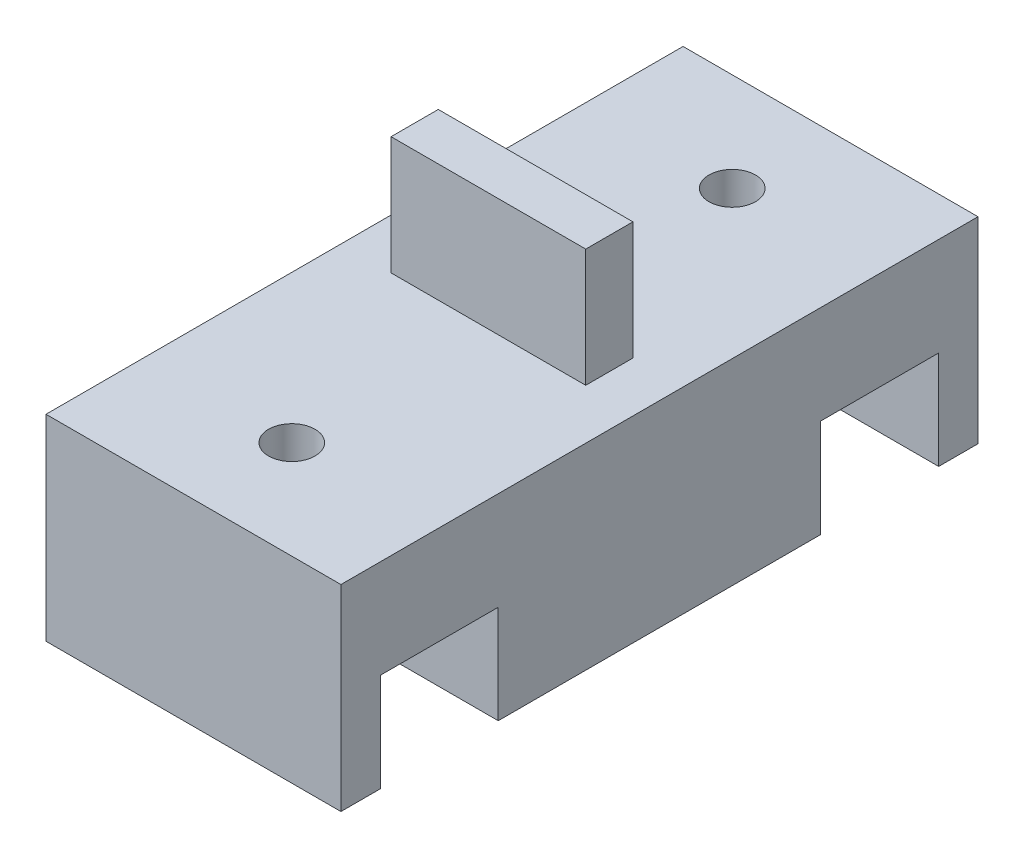
ISO-10303-21;
HEADER;
FILE_DESCRIPTION(('STEP AP214'),'2;1');
FILE_NAME('part.step','',(''),(''),'','','');
FILE_SCHEMA(('AUTOMOTIVE_DESIGN { 1 0 10303 214 1 1 1 1 }'));
ENDSEC;
DATA;
#1=APPLICATION_CONTEXT('core data for automotive mechanical design processes');
#2=APPLICATION_PROTOCOL_DEFINITION('international standard','automotive_design',2000,#1);
#3=PRODUCT_CONTEXT('',#1,'mechanical');
#4=PRODUCT('Part','Part','',(#3));
#5=PRODUCT_RELATED_PRODUCT_CATEGORY('part','',(#4));
#6=PRODUCT_DEFINITION_FORMATION('','',#4);
#7=PRODUCT_DEFINITION_CONTEXT('part definition',#1,'design');
#8=PRODUCT_DEFINITION('design','',#6,#7);
#9=PRODUCT_DEFINITION_SHAPE('','',#8);
#10=(LENGTH_UNIT() NAMED_UNIT(*) SI_UNIT(.MILLI.,.METRE.));
#11=(NAMED_UNIT(*) PLANE_ANGLE_UNIT() SI_UNIT($,.RADIAN.));
#12=(NAMED_UNIT(*) SI_UNIT($,.STERADIAN.) SOLID_ANGLE_UNIT());
#13=UNCERTAINTY_MEASURE_WITH_UNIT(LENGTH_MEASURE(1.E-05),#10,'distance_accuracy_value','');
#14=(GEOMETRIC_REPRESENTATION_CONTEXT(3) GLOBAL_UNCERTAINTY_ASSIGNED_CONTEXT((#13)) GLOBAL_UNIT_ASSIGNED_CONTEXT((#10,
#11,#12)) REPRESENTATION_CONTEXT('',''));
#15=CARTESIAN_POINT('',(0.,0.,0.));
#16=DIRECTION('',(0.,0.,1.));
#17=DIRECTION('',(1.,0.,0.));
#18=AXIS2_PLACEMENT_3D('',#15,#16,#17);
#19=CARTESIAN_POINT('',(9.525,0.,0.));
#20=DIRECTION('',(0.,1.,0.));
#21=DIRECTION('',(0.,0.,1.));
#22=AXIS2_PLACEMENT_3D('',#19,#20,#21);
#23=PLANE('',#22);
#24=DIRECTION('',(-1.,0.,0.));
#25=VECTOR('',#24,1.);
#26=CARTESIAN_POINT('',(0.,0.,-18.034));
#27=LINE('',#26,#25);
#28=CARTESIAN_POINT('',(9.525,0.,-18.034));
#29=VERTEX_POINT('',#28);
#30=CARTESIAN_POINT('',(-9.525,0.,-18.034));
#31=VERTEX_POINT('',#30);
#32=EDGE_CURVE('E154',#29,#31,#27,.T.);
#33=ORIENTED_EDGE('',*,*,#32,.T.);
#34=DIRECTION('',(0.,0.,-1.));
#35=VECTOR('',#34,1.);
#36=CARTESIAN_POINT('',(-9.525,0.,0.));
#37=LINE('',#36,#35);
#38=CARTESIAN_POINT('',(-9.525,0.,-20.574));
#39=VERTEX_POINT('',#38);
#40=EDGE_CURVE('E273',#31,#39,#37,.T.);
#41=ORIENTED_EDGE('',*,*,#40,.T.);
#42=DIRECTION('',(-1.,0.,0.));
#43=VECTOR('',#42,1.);
#44=CARTESIAN_POINT('',(9.525,0.,-20.574));
#45=LINE('',#44,#43);
#46=CARTESIAN_POINT('',(9.525,0.,-20.574));
#47=VERTEX_POINT('',#46);
#48=EDGE_CURVE('E264',#47,#39,#45,.T.);
#49=ORIENTED_EDGE('',*,*,#48,.F.);
#50=DIRECTION('',(0.,0.,-1.));
#51=VECTOR('',#50,1.);
#52=CARTESIAN_POINT('',(9.525,0.,0.));
#53=LINE('',#52,#51);
#54=EDGE_CURVE('E260',#29,#47,#53,.T.);
#55=ORIENTED_EDGE('',*,*,#54,.F.);
#56=EDGE_LOOP('',(#33,#41,#49,#55));
#57=FACE_BOUND('',#56,.T.);
#58=ADVANCED_FACE('F36',(#57),#23,.F.);
#59=DIRECTION('',(1.,0.,0.));
#60=VECTOR('',#59,1.);
#61=CARTESIAN_POINT('',(0.,0.,-10.414));
#62=LINE('',#61,#60);
#63=CARTESIAN_POINT('',(-9.525,0.,-10.414));
#64=VERTEX_POINT('',#63);
#65=CARTESIAN_POINT('',(9.525,0.,-10.414));
#66=VERTEX_POINT('',#65);
#67=EDGE_CURVE('E168',#64,#66,#62,.T.);
#68=ORIENTED_EDGE('',*,*,#67,.T.);
#69=CARTESIAN_POINT('',(9.525,0.,10.414));
#70=VERTEX_POINT('',#69);
#71=EDGE_CURVE('E265',#70,#66,#53,.T.);
#72=ORIENTED_EDGE('',*,*,#71,.F.);
#73=DIRECTION('',(1.,0.,0.));
#74=VECTOR('',#73,1.);
#75=CARTESIAN_POINT('',(0.,0.,10.414));
#76=LINE('',#75,#74);
#77=CARTESIAN_POINT('',(-9.525,0.,10.414));
#78=VERTEX_POINT('',#77);
#79=EDGE_CURVE('E191',#78,#70,#76,.T.);
#80=ORIENTED_EDGE('',*,*,#79,.F.);
#81=EDGE_CURVE('E276',#78,#64,#37,.T.);
#82=ORIENTED_EDGE('',*,*,#81,.T.);
#83=EDGE_LOOP('',(#68,#72,#80,#82));
#84=FACE_BOUND('',#83,.T.);
#85=ADVANCED_FACE('F303',(#84),#23,.F.);
#86=CARTESIAN_POINT('',(-9.525,0.,20.574));
#87=VERTEX_POINT('',#86);
#88=CARTESIAN_POINT('',(-9.525,0.,18.034));
#89=VERTEX_POINT('',#88);
#90=EDGE_CURVE('E255',#87,#89,#37,.T.);
#91=ORIENTED_EDGE('',*,*,#90,.T.);
#92=DIRECTION('',(-1.,0.,0.));
#93=VECTOR('',#92,1.);
#94=CARTESIAN_POINT('',(0.,0.,18.034));
#95=LINE('',#94,#93);
#96=CARTESIAN_POINT('',(9.525,0.,18.034));
#97=VERTEX_POINT('',#96);
#98=EDGE_CURVE('E202',#97,#89,#95,.T.);
#99=ORIENTED_EDGE('',*,*,#98,.F.);
#100=CARTESIAN_POINT('',(9.525,0.,20.574));
#101=VERTEX_POINT('',#100);
#102=EDGE_CURVE('E261',#101,#97,#53,.T.);
#103=ORIENTED_EDGE('',*,*,#102,.F.);
#104=DIRECTION('',(-1.,0.,0.));
#105=VECTOR('',#104,1.);
#106=CARTESIAN_POINT('',(9.525,0.,20.574));
#107=LINE('',#106,#105);
#108=EDGE_CURVE('E279',#101,#87,#107,.T.);
#109=ORIENTED_EDGE('',*,*,#108,.T.);
#110=EDGE_LOOP('',(#91,#99,#103,#109));
#111=FACE_BOUND('',#110,.T.);
#112=ADVANCED_FACE('F320',(#111),#23,.F.);
#113=CARTESIAN_POINT('',(9.525,0.,0.));
#114=DIRECTION('',(1.,0.,0.));
#115=DIRECTION('',(0.,0.,-1.));
#116=AXIS2_PLACEMENT_3D('',#113,#114,#115);
#117=PLANE('',#116);
#118=DIRECTION('',(0.,0.,1.));
#119=VECTOR('',#118,1.);
#120=CARTESIAN_POINT('',(9.525,6.35,0.));
#121=LINE('',#120,#119);
#122=CARTESIAN_POINT('',(9.525,6.35,-18.034));
#123=VERTEX_POINT('',#122);
#124=CARTESIAN_POINT('',(9.525,6.35,-10.414));
#125=VERTEX_POINT('',#124);
#126=EDGE_CURVE('E163',#123,#125,#121,.T.);
#127=ORIENTED_EDGE('',*,*,#126,.F.);
#128=DIRECTION('',(0.,-1.,0.));
#129=VECTOR('',#128,1.);
#130=CARTESIAN_POINT('',(9.525,6.35,-18.034));
#131=LINE('',#130,#129);
#132=EDGE_CURVE('E149',#123,#29,#131,.T.);
#133=ORIENTED_EDGE('',*,*,#132,.T.);
#134=ORIENTED_EDGE('',*,*,#54,.T.);
#135=DIRECTION('',(0.,-1.,0.));
#136=VECTOR('',#135,1.);
#137=CARTESIAN_POINT('',(9.525,0.,-20.574));
#138=LINE('',#137,#136);
#139=CARTESIAN_POINT('',(9.525,12.7,-20.574));
#140=VERTEX_POINT('',#139);
#141=EDGE_CURVE('E251',#140,#47,#138,.T.);
#142=ORIENTED_EDGE('',*,*,#141,.F.);
#143=DIRECTION('',(0.,0.,-1.));
#144=VECTOR('',#143,1.);
#145=CARTESIAN_POINT('',(9.525,12.7,0.));
#146=LINE('',#145,#144);
#147=CARTESIAN_POINT('',(9.525,12.7,20.574));
#148=VERTEX_POINT('',#147);
#149=EDGE_CURVE('E254',#148,#140,#146,.T.);
#150=ORIENTED_EDGE('',*,*,#149,.F.);
#151=DIRECTION('',(0.,-1.,0.));
#152=VECTOR('',#151,1.);
#153=CARTESIAN_POINT('',(9.525,0.,20.574));
#154=LINE('',#153,#152);
#155=EDGE_CURVE('E258',#148,#101,#154,.T.);
#156=ORIENTED_EDGE('',*,*,#155,.T.);
#157=ORIENTED_EDGE('',*,*,#102,.T.);
#158=DIRECTION('',(0.,-1.,0.));
#159=VECTOR('',#158,1.);
#160=CARTESIAN_POINT('',(9.525,6.35,18.034));
#161=LINE('',#160,#159);
#162=CARTESIAN_POINT('',(9.525,6.35,18.034));
#163=VERTEX_POINT('',#162);
#164=EDGE_CURVE('E179',#163,#97,#161,.T.);
#165=ORIENTED_EDGE('',*,*,#164,.F.);
#166=DIRECTION('',(0.,0.,1.));
#167=VECTOR('',#166,1.);
#168=CARTESIAN_POINT('',(9.525,6.35,0.));
#169=LINE('',#168,#167);
#170=CARTESIAN_POINT('',(9.525,6.35,10.414));
#171=VERTEX_POINT('',#170);
#172=EDGE_CURVE('E196',#171,#163,#169,.T.);
#173=ORIENTED_EDGE('',*,*,#172,.F.);
#174=DIRECTION('',(0.,-1.,0.));
#175=VECTOR('',#174,1.);
#176=CARTESIAN_POINT('',(9.525,6.35,10.414));
#177=LINE('',#176,#175);
#178=EDGE_CURVE('E206',#171,#70,#177,.T.);
#179=ORIENTED_EDGE('',*,*,#178,.T.);
#180=ORIENTED_EDGE('',*,*,#71,.T.);
#181=DIRECTION('',(0.,-1.,0.));
#182=VECTOR('',#181,1.);
#183=CARTESIAN_POINT('',(9.525,6.35,-10.414));
#184=LINE('',#183,#182);
#185=EDGE_CURVE('E158',#125,#66,#184,.T.);
#186=ORIENTED_EDGE('',*,*,#185,.F.);
#187=EDGE_LOOP('',(#127,#133,#134,#142,#150,#156,#157,#165,#173,#179,#180,#186));
#188=FACE_BOUND('',#187,.T.);
#189=ADVANCED_FACE('F170',(#188),#117,.T.);
#190=CARTESIAN_POINT('',(-9.525,0.,0.));
#191=DIRECTION('',(1.,0.,0.));
#192=DIRECTION('',(0.,0.,-1.));
#193=AXIS2_PLACEMENT_3D('',#190,#191,#192);
#194=PLANE('',#193);
#195=DIRECTION('',(0.,-1.,0.));
#196=VECTOR('',#195,1.);
#197=CARTESIAN_POINT('',(-9.525,6.35,-18.034));
#198=LINE('',#197,#196);
#199=CARTESIAN_POINT('',(-9.525,6.35,-18.034));
#200=VERTEX_POINT('',#199);
#201=EDGE_CURVE('E182',#200,#31,#198,.T.);
#202=ORIENTED_EDGE('',*,*,#201,.F.);
#203=DIRECTION('',(0.,0.,-1.));
#204=VECTOR('',#203,1.);
#205=CARTESIAN_POINT('',(-9.525,6.35,0.));
#206=LINE('',#205,#204);
#207=CARTESIAN_POINT('',(-9.525,6.35,-10.414));
#208=VERTEX_POINT('',#207);
#209=EDGE_CURVE('E166',#208,#200,#206,.T.);
#210=ORIENTED_EDGE('',*,*,#209,.F.);
#211=DIRECTION('',(0.,-1.,0.));
#212=VECTOR('',#211,1.);
#213=CARTESIAN_POINT('',(-9.525,6.35,-10.414));
#214=LINE('',#213,#212);
#215=EDGE_CURVE('E185',#208,#64,#214,.T.);
#216=ORIENTED_EDGE('',*,*,#215,.T.);
#217=ORIENTED_EDGE('',*,*,#81,.F.);
#218=DIRECTION('',(0.,-1.,0.));
#219=VECTOR('',#218,1.);
#220=CARTESIAN_POINT('',(-9.525,6.35,10.414));
#221=LINE('',#220,#219);
#222=CARTESIAN_POINT('',(-9.525,6.35,10.414));
#223=VERTEX_POINT('',#222);
#224=EDGE_CURVE('E209',#223,#78,#221,.T.);
#225=ORIENTED_EDGE('',*,*,#224,.F.);
#226=DIRECTION('',(0.,0.,-1.));
#227=VECTOR('',#226,1.);
#228=CARTESIAN_POINT('',(-9.525,6.35,0.));
#229=LINE('',#228,#227);
#230=CARTESIAN_POINT('',(-9.525,6.35,18.034));
#231=VERTEX_POINT('',#230);
#232=EDGE_CURVE('E190',#231,#223,#229,.T.);
#233=ORIENTED_EDGE('',*,*,#232,.F.);
#234=DIRECTION('',(0.,-1.,0.));
#235=VECTOR('',#234,1.);
#236=CARTESIAN_POINT('',(-9.525,6.35,18.034));
#237=LINE('',#236,#235);
#238=EDGE_CURVE('E201',#231,#89,#237,.T.);
#239=ORIENTED_EDGE('',*,*,#238,.T.);
#240=ORIENTED_EDGE('',*,*,#90,.F.);
#241=DIRECTION('',(0.,-1.,0.));
#242=VECTOR('',#241,1.);
#243=CARTESIAN_POINT('',(-9.525,0.,20.574));
#244=LINE('',#243,#242);
#245=CARTESIAN_POINT('',(-9.525,12.7,20.574));
#246=VERTEX_POINT('',#245);
#247=EDGE_CURVE('E271',#246,#87,#244,.T.);
#248=ORIENTED_EDGE('',*,*,#247,.F.);
#249=DIRECTION('',(0.,0.,-1.));
#250=VECTOR('',#249,1.);
#251=CARTESIAN_POINT('',(-9.525,12.7,0.));
#252=LINE('',#251,#250);
#253=CARTESIAN_POINT('',(-9.525,12.7,-20.574));
#254=VERTEX_POINT('',#253);
#255=EDGE_CURVE('E268',#246,#254,#252,.T.);
#256=ORIENTED_EDGE('',*,*,#255,.T.);
#257=DIRECTION('',(0.,-1.,0.));
#258=VECTOR('',#257,1.);
#259=CARTESIAN_POINT('',(-9.525,0.,-20.574));
#260=LINE('',#259,#258);
#261=EDGE_CURVE('E250',#254,#39,#260,.T.);
#262=ORIENTED_EDGE('',*,*,#261,.T.);
#263=ORIENTED_EDGE('',*,*,#40,.F.);
#264=EDGE_LOOP('',(#202,#210,#216,#217,#225,#233,#239,#240,#248,#256,#262,#263));
#265=FACE_BOUND('',#264,.T.);
#266=ADVANCED_FACE('F291',(#265),#194,.F.);
#267=CARTESIAN_POINT('',(0.,0.,-14.224));
#268=DIRECTION('',(0.,1.,0.));
#269=DIRECTION('',(0.,0.,1.));
#270=AXIS2_PLACEMENT_3D('',#267,#268,#269);
#271=CYLINDRICAL_SURFACE('',#270,1.5);
#272=CARTESIAN_POINT('',(0.,12.7,-14.224));
#273=DIRECTION('',(0.,1.,0.));
#274=DIRECTION('',(0.,0.,1.));
#275=AXIS2_PLACEMENT_3D('',#272,#273,#274);
#276=CIRCLE('',#275,1.5);
#277=CARTESIAN_POINT('',(0.,12.7,-12.724));
#278=VERTEX_POINT('',#277);
#279=EDGE_CURVE('E184',#278,#278,#276,.T.);
#280=ORIENTED_EDGE('',*,*,#279,.T.);
#281=EDGE_LOOP('',(#280));
#282=FACE_BOUND('',#281,.T.);
#283=CARTESIAN_POINT('',(0.,6.35,-14.224));
#284=DIRECTION('',(0.,-1.,0.));
#285=DIRECTION('',(0.,0.,-1.));
#286=AXIS2_PLACEMENT_3D('',#283,#284,#285);
#287=CIRCLE('',#286,1.5);
#288=CARTESIAN_POINT('',(0.,6.35,-15.724));
#289=VERTEX_POINT('',#288);
#290=EDGE_CURVE('E159',#289,#289,#287,.F.);
#291=ORIENTED_EDGE('',*,*,#290,.F.);
#292=EDGE_LOOP('',(#291));
#293=FACE_BOUND('',#292,.T.);
#294=ADVANCED_FACE('F357',(#282,#293),#271,.F.);
#295=CARTESIAN_POINT('',(0.,0.,14.224));
#296=DIRECTION('',(0.,1.,0.));
#297=DIRECTION('',(0.,0.,1.));
#298=AXIS2_PLACEMENT_3D('',#295,#296,#297);
#299=CYLINDRICAL_SURFACE('',#298,1.5);
#300=CARTESIAN_POINT('',(0.,12.7,14.224));
#301=DIRECTION('',(0.,1.,0.));
#302=DIRECTION('',(0.,0.,1.));
#303=AXIS2_PLACEMENT_3D('',#300,#301,#302);
#304=CIRCLE('',#303,1.5);
#305=CARTESIAN_POINT('',(0.,12.7,15.724));
#306=VERTEX_POINT('',#305);
#307=EDGE_CURVE('E213',#306,#306,#304,.T.);
#308=ORIENTED_EDGE('',*,*,#307,.T.);
#309=EDGE_LOOP('',(#308));
#310=FACE_BOUND('',#309,.T.);
#311=CARTESIAN_POINT('',(0.,6.35,14.224));
#312=DIRECTION('',(0.,-1.,0.));
#313=DIRECTION('',(0.,0.,-1.));
#314=AXIS2_PLACEMENT_3D('',#311,#312,#313);
#315=CIRCLE('',#314,1.5);
#316=CARTESIAN_POINT('',(0.,6.35,12.724));
#317=VERTEX_POINT('',#316);
#318=EDGE_CURVE('E198',#317,#317,#315,.F.);
#319=ORIENTED_EDGE('',*,*,#318,.F.);
#320=EDGE_LOOP('',(#319));
#321=FACE_BOUND('',#320,.T.);
#322=ADVANCED_FACE('F354',(#310,#321),#299,.F.);
#323=CARTESIAN_POINT('',(9.525,0.,-20.574));
#324=DIRECTION('',(0.,0.,-1.));
#325=DIRECTION('',(0.,1.,0.));
#326=AXIS2_PLACEMENT_3D('',#323,#324,#325);
#327=PLANE('',#326);
#328=ORIENTED_EDGE('',*,*,#261,.F.);
#329=DIRECTION('',(-1.,0.,0.));
#330=VECTOR('',#329,1.);
#331=CARTESIAN_POINT('',(9.525,12.7,-20.574));
#332=LINE('',#331,#330);
#333=EDGE_CURVE('E11',#140,#254,#332,.T.);
#334=ORIENTED_EDGE('',*,*,#333,.F.);
#335=ORIENTED_EDGE('',*,*,#141,.T.);
#336=ORIENTED_EDGE('',*,*,#48,.T.);
#337=EDGE_LOOP('',(#328,#334,#335,#336));
#338=FACE_BOUND('',#337,.T.);
#339=ADVANCED_FACE('F38',(#338),#327,.T.);
#340=CARTESIAN_POINT('',(9.525,12.7,0.));
#341=DIRECTION('',(0.,1.,0.));
#342=DIRECTION('',(0.,0.,1.));
#343=AXIS2_PLACEMENT_3D('',#340,#341,#342);
#344=PLANE('',#343);
#345=ORIENTED_EDGE('',*,*,#307,.F.);
#346=EDGE_LOOP('',(#345));
#347=FACE_BOUND('',#346,.T.);
#348=ORIENTED_EDGE('',*,*,#279,.F.);
#349=EDGE_LOOP('',(#348));
#350=FACE_BOUND('',#349,.T.);
#351=DIRECTION('',(0.,0.,-1.));
#352=VECTOR('',#351,1.);
#353=CARTESIAN_POINT('',(6.2865,12.7,0.));
#354=LINE('',#353,#352);
#355=CARTESIAN_POINT('',(6.2865,12.7,1.524));
#356=VERTEX_POINT('',#355);
#357=CARTESIAN_POINT('',(6.2865,12.7,-1.524));
#358=VERTEX_POINT('',#357);
#359=EDGE_CURVE('E219',#356,#358,#354,.T.);
#360=ORIENTED_EDGE('',*,*,#359,.F.);
#361=DIRECTION('',(-1.,0.,0.));
#362=VECTOR('',#361,1.);
#363=CARTESIAN_POINT('',(6.2865,12.7,1.524));
#364=LINE('',#363,#362);
#365=CARTESIAN_POINT('',(-6.2865,12.7,1.524));
#366=VERTEX_POINT('',#365);
#367=EDGE_CURVE('E231',#356,#366,#364,.T.);
#368=ORIENTED_EDGE('',*,*,#367,.T.);
#369=DIRECTION('',(0.,0.,-1.));
#370=VECTOR('',#369,1.);
#371=CARTESIAN_POINT('',(-6.2865,12.7,0.));
#372=LINE('',#371,#370);
#373=CARTESIAN_POINT('',(-6.2865,12.7,-1.524));
#374=VERTEX_POINT('',#373);
#375=EDGE_CURVE('E216',#366,#374,#372,.T.);
#376=ORIENTED_EDGE('',*,*,#375,.T.);
#377=DIRECTION('',(-1.,0.,0.));
#378=VECTOR('',#377,1.);
#379=CARTESIAN_POINT('',(6.2865,12.7,-1.524));
#380=LINE('',#379,#378);
#381=EDGE_CURVE('E248',#358,#374,#380,.T.);
#382=ORIENTED_EDGE('',*,*,#381,.F.);
#383=EDGE_LOOP('',(#360,#368,#376,#382));
#384=FACE_BOUND('',#383,.T.);
#385=ORIENTED_EDGE('',*,*,#255,.F.);
#386=DIRECTION('',(-1.,0.,0.));
#387=VECTOR('',#386,1.);
#388=CARTESIAN_POINT('',(9.525,12.7,20.574));
#389=LINE('',#388,#387);
#390=EDGE_CURVE('E44',#148,#246,#389,.T.);
#391=ORIENTED_EDGE('',*,*,#390,.F.);
#392=ORIENTED_EDGE('',*,*,#149,.T.);
#393=ORIENTED_EDGE('',*,*,#333,.T.);
#394=EDGE_LOOP('',(#385,#391,#392,#393));
#395=FACE_BOUND('',#394,.T.);
#396=ADVANCED_FACE('F292',(#347,#350,#384,#395),#344,.T.);
#397=CARTESIAN_POINT('',(9.525,0.,20.574));
#398=DIRECTION('',(0.,0.,-1.));
#399=DIRECTION('',(0.,1.,0.));
#400=AXIS2_PLACEMENT_3D('',#397,#398,#399);
#401=PLANE('',#400);
#402=ORIENTED_EDGE('',*,*,#247,.T.);
#403=ORIENTED_EDGE('',*,*,#108,.F.);
#404=ORIENTED_EDGE('',*,*,#155,.F.);
#405=ORIENTED_EDGE('',*,*,#390,.T.);
#406=EDGE_LOOP('',(#402,#403,#404,#405));
#407=FACE_BOUND('',#406,.T.);
#408=ADVANCED_FACE('F284',(#407),#401,.F.);
#409=CARTESIAN_POINT('',(6.2865,0.,-1.524));
#410=DIRECTION('',(0.,0.,1.));
#411=DIRECTION('',(0.,-1.,0.));
#412=AXIS2_PLACEMENT_3D('',#409,#410,#411);
#413=PLANE('',#412);
#414=DIRECTION('',(0.,1.,0.));
#415=VECTOR('',#414,1.);
#416=CARTESIAN_POINT('',(-6.2865,0.,-1.524));
#417=LINE('',#416,#415);
#418=CARTESIAN_POINT('',(-6.2865,20.32,-1.524));
#419=VERTEX_POINT('',#418);
#420=EDGE_CURVE('E234',#374,#419,#417,.T.);
#421=ORIENTED_EDGE('',*,*,#420,.T.);
#422=DIRECTION('',(-1.,0.,0.));
#423=VECTOR('',#422,1.);
#424=CARTESIAN_POINT('',(6.2865,20.32,-1.524));
#425=LINE('',#424,#423);
#426=CARTESIAN_POINT('',(6.2865,20.32,-1.524));
#427=VERTEX_POINT('',#426);
#428=EDGE_CURVE('E246',#427,#419,#425,.T.);
#429=ORIENTED_EDGE('',*,*,#428,.F.);
#430=DIRECTION('',(0.,1.,0.));
#431=VECTOR('',#430,1.);
#432=CARTESIAN_POINT('',(6.2865,0.,-1.524));
#433=LINE('',#432,#431);
#434=EDGE_CURVE('E222',#358,#427,#433,.T.);
#435=ORIENTED_EDGE('',*,*,#434,.F.);
#436=ORIENTED_EDGE('',*,*,#381,.T.);
#437=EDGE_LOOP('',(#421,#429,#435,#436));
#438=FACE_BOUND('',#437,.T.);
#439=ADVANCED_FACE('F372',(#438),#413,.F.);
#440=CARTESIAN_POINT('',(6.2865,20.32,0.));
#441=DIRECTION('',(0.,1.,0.));
#442=DIRECTION('',(0.,0.,1.));
#443=AXIS2_PLACEMENT_3D('',#440,#441,#442);
#444=PLANE('',#443);
#445=DIRECTION('',(0.,0.,-1.));
#446=VECTOR('',#445,1.);
#447=CARTESIAN_POINT('',(-6.2865,20.32,0.));
#448=LINE('',#447,#446);
#449=CARTESIAN_POINT('',(-6.2865,20.32,1.524));
#450=VERTEX_POINT('',#449);
#451=EDGE_CURVE('E237',#450,#419,#448,.T.);
#452=ORIENTED_EDGE('',*,*,#451,.F.);
#453=DIRECTION('',(-1.,0.,0.));
#454=VECTOR('',#453,1.);
#455=CARTESIAN_POINT('',(6.2865,20.32,1.524));
#456=LINE('',#455,#454);
#457=CARTESIAN_POINT('',(6.2865,20.32,1.524));
#458=VERTEX_POINT('',#457);
#459=EDGE_CURVE('E244',#458,#450,#456,.T.);
#460=ORIENTED_EDGE('',*,*,#459,.F.);
#461=DIRECTION('',(0.,0.,-1.));
#462=VECTOR('',#461,1.);
#463=CARTESIAN_POINT('',(6.2865,20.32,0.));
#464=LINE('',#463,#462);
#465=EDGE_CURVE('E225',#458,#427,#464,.T.);
#466=ORIENTED_EDGE('',*,*,#465,.T.);
#467=ORIENTED_EDGE('',*,*,#428,.T.);
#468=EDGE_LOOP('',(#452,#460,#466,#467));
#469=FACE_BOUND('',#468,.T.);
#470=ADVANCED_FACE('F368',(#469),#444,.T.);
#471=CARTESIAN_POINT('',(6.2865,0.,1.52399999999999));
#472=DIRECTION('',(0.,0.,1.));
#473=DIRECTION('',(0.,-1.,0.));
#474=AXIS2_PLACEMENT_3D('',#471,#472,#473);
#475=PLANE('',#474);
#476=DIRECTION('',(0.,1.,0.));
#477=VECTOR('',#476,1.);
#478=CARTESIAN_POINT('',(-6.2865,0.,1.52399999999999));
#479=LINE('',#478,#477);
#480=EDGE_CURVE('E223',#366,#450,#479,.T.);
#481=ORIENTED_EDGE('',*,*,#480,.F.);
#482=ORIENTED_EDGE('',*,*,#367,.F.);
#483=DIRECTION('',(0.,1.,0.));
#484=VECTOR('',#483,1.);
#485=CARTESIAN_POINT('',(6.2865,0.,1.52399999999999));
#486=LINE('',#485,#484);
#487=EDGE_CURVE('E228',#356,#458,#486,.T.);
#488=ORIENTED_EDGE('',*,*,#487,.T.);
#489=ORIENTED_EDGE('',*,*,#459,.T.);
#490=EDGE_LOOP('',(#481,#482,#488,#489));
#491=FACE_BOUND('',#490,.T.);
#492=ADVANCED_FACE('F363',(#491),#475,.T.);
#493=CARTESIAN_POINT('',(6.2865,0.,0.));
#494=DIRECTION('',(1.,0.,0.));
#495=DIRECTION('',(0.,0.,-1.));
#496=AXIS2_PLACEMENT_3D('',#493,#494,#495);
#497=PLANE('',#496);
#498=ORIENTED_EDGE('',*,*,#359,.T.);
#499=ORIENTED_EDGE('',*,*,#434,.T.);
#500=ORIENTED_EDGE('',*,*,#465,.F.);
#501=ORIENTED_EDGE('',*,*,#487,.F.);
#502=EDGE_LOOP('',(#498,#499,#500,#501));
#503=FACE_BOUND('',#502,.T.);
#504=ADVANCED_FACE('F349',(#503),#497,.T.);
#505=CARTESIAN_POINT('',(-6.2865,0.,0.));
#506=DIRECTION('',(1.,0.,0.));
#507=DIRECTION('',(0.,0.,-1.));
#508=AXIS2_PLACEMENT_3D('',#505,#506,#507);
#509=PLANE('',#508);
#510=ORIENTED_EDGE('',*,*,#375,.F.);
#511=ORIENTED_EDGE('',*,*,#480,.T.);
#512=ORIENTED_EDGE('',*,*,#451,.T.);
#513=ORIENTED_EDGE('',*,*,#420,.F.);
#514=EDGE_LOOP('',(#510,#511,#512,#513));
#515=FACE_BOUND('',#514,.T.);
#516=ADVANCED_FACE('F342',(#515),#509,.F.);
#517=CARTESIAN_POINT('',(0.,6.35,18.034));
#518=DIRECTION('',(0.,0.,1.));
#519=DIRECTION('',(0.,-1.,0.));
#520=AXIS2_PLACEMENT_3D('',#517,#518,#519);
#521=PLANE('',#520);
#522=ORIENTED_EDGE('',*,*,#98,.T.);
#523=ORIENTED_EDGE('',*,*,#238,.F.);
#524=DIRECTION('',(-1.,0.,0.));
#525=VECTOR('',#524,1.);
#526=CARTESIAN_POINT('',(0.,6.35,18.034));
#527=LINE('',#526,#525);
#528=EDGE_CURVE('E59',#163,#231,#527,.T.);
#529=ORIENTED_EDGE('',*,*,#528,.F.);
#530=ORIENTED_EDGE('',*,*,#164,.T.);
#531=EDGE_LOOP('',(#522,#523,#529,#530));
#532=FACE_BOUND('',#531,.T.);
#533=ADVANCED_FACE('F340',(#532),#521,.F.);
#534=CARTESIAN_POINT('',(0.,6.35,10.414));
#535=DIRECTION('',(0.,0.,-1.));
#536=DIRECTION('',(0.,1.,0.));
#537=AXIS2_PLACEMENT_3D('',#534,#535,#536);
#538=PLANE('',#537);
#539=ORIENTED_EDGE('',*,*,#79,.T.);
#540=ORIENTED_EDGE('',*,*,#178,.F.);
#541=DIRECTION('',(1.,0.,0.));
#542=VECTOR('',#541,1.);
#543=CARTESIAN_POINT('',(0.,6.35,10.414));
#544=LINE('',#543,#542);
#545=EDGE_CURVE('E193',#223,#171,#544,.T.);
#546=ORIENTED_EDGE('',*,*,#545,.F.);
#547=ORIENTED_EDGE('',*,*,#224,.T.);
#548=EDGE_LOOP('',(#539,#540,#546,#547));
#549=FACE_BOUND('',#548,.T.);
#550=ADVANCED_FACE('F337',(#549),#538,.F.);
#551=CARTESIAN_POINT('',(0.,6.35,0.));
#552=DIRECTION('',(0.,-1.,0.));
#553=DIRECTION('',(0.,0.,-1.));
#554=AXIS2_PLACEMENT_3D('',#551,#552,#553);
#555=PLANE('',#554);
#556=ORIENTED_EDGE('',*,*,#528,.T.);
#557=ORIENTED_EDGE('',*,*,#232,.T.);
#558=ORIENTED_EDGE('',*,*,#545,.T.);
#559=ORIENTED_EDGE('',*,*,#172,.T.);
#560=EDGE_LOOP('',(#556,#557,#558,#559));
#561=FACE_BOUND('',#560,.T.);
#562=ORIENTED_EDGE('',*,*,#318,.T.);
#563=EDGE_LOOP('',(#562));
#564=FACE_BOUND('',#563,.T.);
#565=ADVANCED_FACE('F316',(#561,#564),#555,.T.);
#566=CARTESIAN_POINT('',(0.,6.35,-18.034));
#567=DIRECTION('',(0.,0.,1.));
#568=DIRECTION('',(1.,0.,0.));
#569=AXIS2_PLACEMENT_3D('',#566,#567,#568);
#570=PLANE('',#569);
#571=ORIENTED_EDGE('',*,*,#32,.F.);
#572=ORIENTED_EDGE('',*,*,#132,.F.);
#573=DIRECTION('',(-1.,0.,0.));
#574=VECTOR('',#573,1.);
#575=CARTESIAN_POINT('',(0.,6.35,-18.034));
#576=LINE('',#575,#574);
#577=EDGE_CURVE('E152',#123,#200,#576,.T.);
#578=ORIENTED_EDGE('',*,*,#577,.T.);
#579=ORIENTED_EDGE('',*,*,#201,.T.);
#580=EDGE_LOOP('',(#571,#572,#578,#579));
#581=FACE_BOUND('',#580,.T.);
#582=ADVANCED_FACE('F151',(#581),#570,.T.);
#583=CARTESIAN_POINT('',(0.,6.35,-10.414));
#584=DIRECTION('',(0.,0.,-1.));
#585=DIRECTION('',(0.,1.,0.));
#586=AXIS2_PLACEMENT_3D('',#583,#584,#585);
#587=PLANE('',#586);
#588=ORIENTED_EDGE('',*,*,#67,.F.);
#589=ORIENTED_EDGE('',*,*,#215,.F.);
#590=DIRECTION('',(1.,0.,0.));
#591=VECTOR('',#590,1.);
#592=CARTESIAN_POINT('',(0.,6.35,-10.414));
#593=LINE('',#592,#591);
#594=EDGE_CURVE('E51',#208,#125,#593,.T.);
#595=ORIENTED_EDGE('',*,*,#594,.T.);
#596=ORIENTED_EDGE('',*,*,#185,.T.);
#597=EDGE_LOOP('',(#588,#589,#595,#596));
#598=FACE_BOUND('',#597,.T.);
#599=ADVANCED_FACE('F308',(#598),#587,.T.);
#600=CARTESIAN_POINT('',(0.,6.35,0.));
#601=DIRECTION('',(0.,-1.,0.));
#602=DIRECTION('',(0.,0.,-1.));
#603=AXIS2_PLACEMENT_3D('',#600,#601,#602);
#604=PLANE('',#603);
#605=ORIENTED_EDGE('',*,*,#577,.F.);
#606=ORIENTED_EDGE('',*,*,#126,.T.);
#607=ORIENTED_EDGE('',*,*,#594,.F.);
#608=ORIENTED_EDGE('',*,*,#209,.T.);
#609=EDGE_LOOP('',(#605,#606,#607,#608));
#610=FACE_BOUND('',#609,.T.);
#611=ORIENTED_EDGE('',*,*,#290,.T.);
#612=EDGE_LOOP('',(#611));
#613=FACE_BOUND('',#612,.T.);
#614=ADVANCED_FACE('F161',(#610,#613),#604,.T.);
#615=CLOSED_SHELL('',(#58,#85,#112,#189,#266,#294,#322,#339,#396,#408,#439,#470,#492,#504,#516,
#533,#550,#565,#582,#599,#614));
#616=MANIFOLD_SOLID_BREP('B2',#615);
#617=ADVANCED_BREP_SHAPE_REPRESENTATION('',(#18,#616),#14);
#618=SHAPE_DEFINITION_REPRESENTATION(#9,#617);
ENDSEC;
END-ISO-10303-21;
